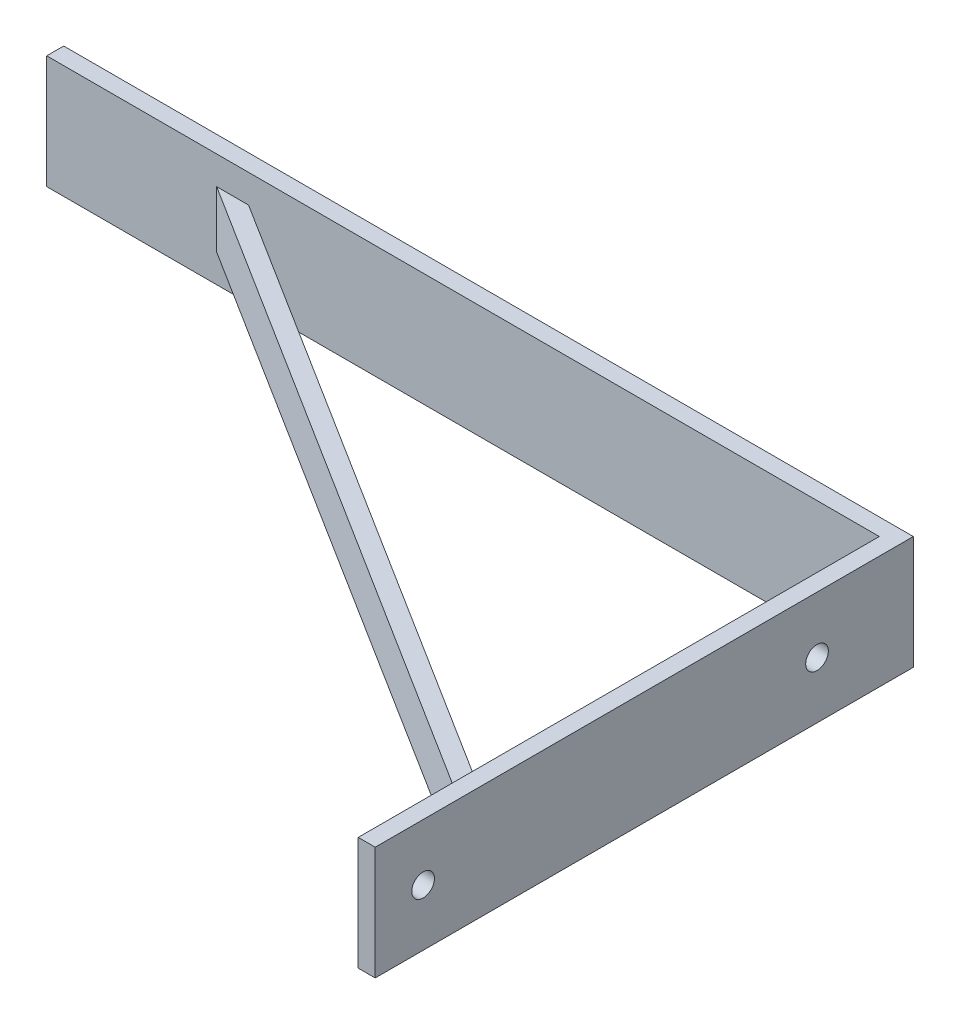
ISO-10303-21;
HEADER;
FILE_DESCRIPTION(('STEP AP214'),'2;1');
FILE_NAME('part.step','',(''),(''),'','','');
FILE_SCHEMA(('AUTOMOTIVE_DESIGN { 1 0 10303 214 1 1 1 1 }'));
ENDSEC;
DATA;
#1=APPLICATION_CONTEXT('core data for automotive mechanical design processes');
#2=APPLICATION_PROTOCOL_DEFINITION('international standard','automotive_design',2000,#1);
#3=PRODUCT_CONTEXT('',#1,'mechanical');
#4=PRODUCT('Part','Part','',(#3));
#5=PRODUCT_RELATED_PRODUCT_CATEGORY('part','',(#4));
#6=PRODUCT_DEFINITION_FORMATION('','',#4);
#7=PRODUCT_DEFINITION_CONTEXT('part definition',#1,'design');
#8=PRODUCT_DEFINITION('design','',#6,#7);
#9=PRODUCT_DEFINITION_SHAPE('','',#8);
#10=(LENGTH_UNIT() NAMED_UNIT(*) SI_UNIT(.MILLI.,.METRE.));
#11=(NAMED_UNIT(*) PLANE_ANGLE_UNIT() SI_UNIT($,.RADIAN.));
#12=(NAMED_UNIT(*) SI_UNIT($,.STERADIAN.) SOLID_ANGLE_UNIT());
#13=UNCERTAINTY_MEASURE_WITH_UNIT(LENGTH_MEASURE(1.E-05),#10,'distance_accuracy_value','');
#14=(GEOMETRIC_REPRESENTATION_CONTEXT(3) GLOBAL_UNCERTAINTY_ASSIGNED_CONTEXT((#13)) GLOBAL_UNIT_ASSIGNED_CONTEXT((#10,
#11,#12)) REPRESENTATION_CONTEXT('',''));
#15=CARTESIAN_POINT('',(0.,0.,0.));
#16=DIRECTION('',(0.,0.,1.));
#17=DIRECTION('',(1.,0.,0.));
#18=AXIS2_PLACEMENT_3D('',#15,#16,#17);
#19=CARTESIAN_POINT('',(-33.1355439491657,20.,52.7152195219303));
#20=DIRECTION('',(0.532174574123282,0.,-0.846634645320343));
#21=DIRECTION('',(-0.846634645320343,0.,-0.532174574123282));
#22=AXIS2_PLACEMENT_3D('',#19,#20,#21);
#23=PLANE('',#22);
#24=DIRECTION('',(0.846634645320343,0.,0.532174574123282));
#25=VECTOR('',#24,1.);
#26=CARTESIAN_POINT('',(-117.,15.,0.));
#27=LINE('',#26,#25);
#28=CARTESIAN_POINT('',(-117.,15.,0.));
#29=VERTEX_POINT('',#28);
#30=CARTESIAN_POINT('',(0.,15.,73.5434411012851));
#31=VERTEX_POINT('',#30);
#32=EDGE_CURVE('E355',#29,#31,#27,.T.);
#33=ORIENTED_EDGE('',*,*,#32,.F.);
#34=DIRECTION('',(0.,-1.,0.));
#35=VECTOR('',#34,1.);
#36=CARTESIAN_POINT('',(-117.,20.,0.));
#37=LINE('',#36,#35);
#38=CARTESIAN_POINT('',(-117.,5.,0.));
#39=VERTEX_POINT('',#38);
#40=EDGE_CURVE('E120',#29,#39,#37,.T.);
#41=ORIENTED_EDGE('',*,*,#40,.T.);
#42=DIRECTION('',(-0.846634645320343,0.,-0.532174574123282));
#43=VECTOR('',#42,1.);
#44=CARTESIAN_POINT('',(0.,5.,73.5434411012851));
#45=LINE('',#44,#43);
#46=CARTESIAN_POINT('',(0.,5.,73.5434411012851));
#47=VERTEX_POINT('',#46);
#48=EDGE_CURVE('E171',#47,#39,#45,.T.);
#49=ORIENTED_EDGE('',*,*,#48,.F.);
#50=DIRECTION('',(0.,-1.,0.));
#51=VECTOR('',#50,1.);
#52=CARTESIAN_POINT('',(0.,20.,73.5434411012851));
#53=LINE('',#52,#51);
#54=EDGE_CURVE('E124',#31,#47,#53,.T.);
#55=ORIENTED_EDGE('',*,*,#54,.F.);
#56=EDGE_LOOP('',(#33,#41,#49,#55));
#57=FACE_BOUND('',#56,.T.);
#58=ADVANCED_FACE('F34',(#57),#23,.F.);
#59=CARTESIAN_POINT('',(-31.5390202267959,20.,50.1753155859692));
#60=DIRECTION('',(0.532174574123282,0.,-0.846634645320343));
#61=DIRECTION('',(-0.846634645320343,0.,-0.532174574123282));
#62=AXIS2_PLACEMENT_3D('',#59,#60,#61);
#63=PLANE('',#62);
#64=DIRECTION('',(0.,-1.,0.));
#65=VECTOR('',#64,1.);
#66=CARTESIAN_POINT('',(-111.36275210077,20.,0.));
#67=LINE('',#66,#65);
#68=CARTESIAN_POINT('',(-111.36275210077,15.,0.));
#69=VERTEX_POINT('',#68);
#70=CARTESIAN_POINT('',(-111.36275210077,5.,0.));
#71=VERTEX_POINT('',#70);
#72=EDGE_CURVE('E38',#69,#71,#67,.T.);
#73=ORIENTED_EDGE('',*,*,#72,.F.);
#74=DIRECTION('',(-0.846634645320343,0.,-0.532174574123282));
#75=VECTOR('',#74,1.);
#76=CARTESIAN_POINT('',(0.,15.,70.));
#77=LINE('',#76,#75);
#78=CARTESIAN_POINT('',(0.,15.,70.));
#79=VERTEX_POINT('',#78);
#80=EDGE_CURVE('E363',#79,#69,#77,.T.);
#81=ORIENTED_EDGE('',*,*,#80,.F.);
#82=DIRECTION('',(0.,-1.,0.));
#83=VECTOR('',#82,1.);
#84=CARTESIAN_POINT('',(0.,20.,70.));
#85=LINE('',#84,#83);
#86=CARTESIAN_POINT('',(0.,5.,70.));
#87=VERTEX_POINT('',#86);
#88=EDGE_CURVE('E128',#79,#87,#85,.T.);
#89=ORIENTED_EDGE('',*,*,#88,.T.);
#90=DIRECTION('',(0.846634645320343,0.,0.532174574123282));
#91=VECTOR('',#90,1.);
#92=CARTESIAN_POINT('',(-111.36275210077,5.,0.));
#93=LINE('',#92,#91);
#94=EDGE_CURVE('E173',#71,#87,#93,.T.);
#95=ORIENTED_EDGE('',*,*,#94,.F.);
#96=EDGE_LOOP('',(#73,#81,#89,#95));
#97=FACE_BOUND('',#96,.T.);
#98=ADVANCED_FACE('F36',(#97),#63,.T.);
#99=CARTESIAN_POINT('',(3.,20.,0.));
#100=DIRECTION('',(-1.,0.,0.));
#101=DIRECTION('',(0.,0.,1.));
#102=AXIS2_PLACEMENT_3D('',#99,#100,#101);
#103=PLANE('',#102);
#104=CARTESIAN_POINT('',(3.,10.,83.5434411012851));
#105=DIRECTION('',(-1.,0.,0.));
#106=DIRECTION('',(0.,0.,1.));
#107=AXIS2_PLACEMENT_3D('',#104,#105,#106);
#108=CIRCLE('',#107,2.);
#109=CARTESIAN_POINT('',(3.,10.,85.5434411012851));
#110=VERTEX_POINT('',#109);
#111=EDGE_CURVE('E190',#110,#110,#108,.T.);
#112=ORIENTED_EDGE('',*,*,#111,.T.);
#113=EDGE_LOOP('',(#112));
#114=FACE_BOUND('',#113,.T.);
#115=CARTESIAN_POINT('',(3.,10.,14.));
#116=DIRECTION('',(-1.,0.,0.));
#117=DIRECTION('',(0.,0.,1.));
#118=AXIS2_PLACEMENT_3D('',#115,#116,#117);
#119=CIRCLE('',#118,2.00000000000001);
#120=CARTESIAN_POINT('',(3.,10.,16.));
#121=VERTEX_POINT('',#120);
#122=EDGE_CURVE('E185',#121,#121,#119,.T.);
#123=ORIENTED_EDGE('',*,*,#122,.T.);
#124=EDGE_LOOP('',(#123));
#125=FACE_BOUND('',#124,.T.);
#126=DIRECTION('',(0.,0.,-1.));
#127=VECTOR('',#126,1.);
#128=CARTESIAN_POINT('',(3.,0.,0.));
#129=LINE('',#128,#127);
#130=CARTESIAN_POINT('',(3.,0.,92.));
#131=VERTEX_POINT('',#130);
#132=CARTESIAN_POINT('',(3.,0.,-3.));
#133=VERTEX_POINT('',#132);
#134=EDGE_CURVE('E192',#131,#133,#129,.T.);
#135=ORIENTED_EDGE('',*,*,#134,.T.);
#136=DIRECTION('',(0.,-1.,0.));
#137=VECTOR('',#136,1.);
#138=CARTESIAN_POINT('',(3.,20.,-3.));
#139=LINE('',#138,#137);
#140=CARTESIAN_POINT('',(3.,20.,-3.));
#141=VERTEX_POINT('',#140);
#142=EDGE_CURVE('E11',#141,#133,#139,.T.);
#143=ORIENTED_EDGE('',*,*,#142,.F.);
#144=DIRECTION('',(0.,0.,-1.));
#145=VECTOR('',#144,1.);
#146=CARTESIAN_POINT('',(3.,20.,0.));
#147=LINE('',#146,#145);
#148=CARTESIAN_POINT('',(3.,20.,92.));
#149=VERTEX_POINT('',#148);
#150=EDGE_CURVE('E195',#149,#141,#147,.T.);
#151=ORIENTED_EDGE('',*,*,#150,.F.);
#152=DIRECTION('',(0.,-1.,0.));
#153=VECTOR('',#152,1.);
#154=CARTESIAN_POINT('',(3.,20.,92.));
#155=LINE('',#154,#153);
#156=EDGE_CURVE('E131',#149,#131,#155,.T.);
#157=ORIENTED_EDGE('',*,*,#156,.T.);
#158=EDGE_LOOP('',(#135,#143,#151,#157));
#159=FACE_BOUND('',#158,.T.);
#160=ADVANCED_FACE('F209',(#114,#125,#159),#103,.F.);
#161=CARTESIAN_POINT('',(0.,20.,-3.));
#162=DIRECTION('',(0.,0.,1.));
#163=DIRECTION('',(1.,0.,0.));
#164=AXIS2_PLACEMENT_3D('',#161,#162,#163);
#165=PLANE('',#164);
#166=DIRECTION('',(-1.,0.,0.));
#167=VECTOR('',#166,1.);
#168=CARTESIAN_POINT('',(0.,0.,-3.));
#169=LINE('',#168,#167);
#170=CARTESIAN_POINT('',(-147.,0.,-2.99999999999998));
#171=VERTEX_POINT('',#170);
#172=EDGE_CURVE('E203',#133,#171,#169,.T.);
#173=ORIENTED_EDGE('',*,*,#172,.T.);
#174=DIRECTION('',(0.,-1.,0.));
#175=VECTOR('',#174,1.);
#176=CARTESIAN_POINT('',(-147.,20.,-2.99999999999998));
#177=LINE('',#176,#175);
#178=CARTESIAN_POINT('',(-147.,20.,-2.99999999999998));
#179=VERTEX_POINT('',#178);
#180=EDGE_CURVE('E44',#179,#171,#177,.T.);
#181=ORIENTED_EDGE('',*,*,#180,.F.);
#182=DIRECTION('',(-1.,0.,0.));
#183=VECTOR('',#182,1.);
#184=CARTESIAN_POINT('',(0.,20.,-3.));
#185=LINE('',#184,#183);
#186=EDGE_CURVE('E112',#141,#179,#185,.T.);
#187=ORIENTED_EDGE('',*,*,#186,.F.);
#188=ORIENTED_EDGE('',*,*,#142,.T.);
#189=EDGE_LOOP('',(#173,#181,#187,#188));
#190=FACE_BOUND('',#189,.T.);
#191=ADVANCED_FACE('F205',(#190),#165,.F.);
#192=CARTESIAN_POINT('',(-147.,20.,0.));
#193=DIRECTION('',(1.,0.,0.));
#194=DIRECTION('',(0.,0.,-1.));
#195=AXIS2_PLACEMENT_3D('',#192,#193,#194);
#196=PLANE('',#195);
#197=DIRECTION('',(0.,0.,1.));
#198=VECTOR('',#197,1.);
#199=CARTESIAN_POINT('',(-147.,0.,0.));
#200=LINE('',#199,#198);
#201=CARTESIAN_POINT('',(-147.,0.,0.));
#202=VERTEX_POINT('',#201);
#203=EDGE_CURVE('E119',#171,#202,#200,.T.);
#204=ORIENTED_EDGE('',*,*,#203,.T.);
#205=DIRECTION('',(0.,-1.,0.));
#206=VECTOR('',#205,1.);
#207=CARTESIAN_POINT('',(-147.,20.,0.));
#208=LINE('',#207,#206);
#209=CARTESIAN_POINT('',(-147.,20.,0.));
#210=VERTEX_POINT('',#209);
#211=EDGE_CURVE('E103',#210,#202,#208,.T.);
#212=ORIENTED_EDGE('',*,*,#211,.F.);
#213=DIRECTION('',(0.,0.,1.));
#214=VECTOR('',#213,1.);
#215=CARTESIAN_POINT('',(-147.,20.,0.));
#216=LINE('',#215,#214);
#217=EDGE_CURVE('E110',#179,#210,#216,.T.);
#218=ORIENTED_EDGE('',*,*,#217,.F.);
#219=ORIENTED_EDGE('',*,*,#180,.T.);
#220=EDGE_LOOP('',(#204,#212,#218,#219));
#221=FACE_BOUND('',#220,.T.);
#222=ADVANCED_FACE('F117',(#221),#196,.F.);
#223=CARTESIAN_POINT('',(0.,20.,0.));
#224=DIRECTION('',(0.,0.,-1.));
#225=DIRECTION('',(-1.,0.,0.));
#226=AXIS2_PLACEMENT_3D('',#223,#224,#225);
#227=PLANE('',#226);
#228=ORIENTED_EDGE('',*,*,#40,.F.);
#229=DIRECTION('',(-1.,0.,0.));
#230=VECTOR('',#229,1.);
#231=CARTESIAN_POINT('',(-111.36275210077,15.,0.));
#232=LINE('',#231,#230);
#233=EDGE_CURVE('E360',#69,#29,#232,.T.);
#234=ORIENTED_EDGE('',*,*,#233,.F.);
#235=ORIENTED_EDGE('',*,*,#72,.T.);
#236=DIRECTION('',(1.,0.,0.));
#237=VECTOR('',#236,1.);
#238=CARTESIAN_POINT('',(-117.,5.,0.));
#239=LINE('',#238,#237);
#240=EDGE_CURVE('E176',#39,#71,#239,.T.);
#241=ORIENTED_EDGE('',*,*,#240,.F.);
#242=EDGE_LOOP('',(#228,#234,#235,#241));
#243=FACE_BOUND('',#242,.T.);
#244=DIRECTION('',(1.,0.,0.));
#245=VECTOR('',#244,1.);
#246=CARTESIAN_POINT('',(0.,0.,0.));
#247=LINE('',#246,#245);
#248=CARTESIAN_POINT('',(0.,0.,0.));
#249=VERTEX_POINT('',#248);
#250=EDGE_CURVE('E199',#202,#249,#247,.T.);
#251=ORIENTED_EDGE('',*,*,#250,.T.);
#252=DIRECTION('',(0.,-1.,0.));
#253=VECTOR('',#252,1.);
#254=CARTESIAN_POINT('',(0.,20.,0.));
#255=LINE('',#254,#253);
#256=CARTESIAN_POINT('',(0.,20.,0.));
#257=VERTEX_POINT('',#256);
#258=EDGE_CURVE('E105',#257,#249,#255,.T.);
#259=ORIENTED_EDGE('',*,*,#258,.F.);
#260=DIRECTION('',(1.,0.,0.));
#261=VECTOR('',#260,1.);
#262=CARTESIAN_POINT('',(0.,20.,0.));
#263=LINE('',#262,#261);
#264=EDGE_CURVE('E90',#210,#257,#263,.T.);
#265=ORIENTED_EDGE('',*,*,#264,.F.);
#266=ORIENTED_EDGE('',*,*,#211,.T.);
#267=EDGE_LOOP('',(#251,#259,#265,#266));
#268=FACE_BOUND('',#267,.T.);
#269=ADVANCED_FACE('F101',(#243,#268),#227,.F.);
#270=CARTESIAN_POINT('',(0.,20.,0.));
#271=DIRECTION('',(1.,0.,0.));
#272=DIRECTION('',(0.,0.,-1.));
#273=AXIS2_PLACEMENT_3D('',#270,#271,#272);
#274=PLANE('',#273);
#275=DIRECTION('',(0.,0.,-1.));
#276=VECTOR('',#275,1.);
#277=CARTESIAN_POINT('',(0.,15.,73.5434411012851));
#278=LINE('',#277,#276);
#279=EDGE_CURVE('E161',#31,#79,#278,.T.);
#280=ORIENTED_EDGE('',*,*,#279,.F.);
#281=ORIENTED_EDGE('',*,*,#54,.T.);
#282=DIRECTION('',(0.,0.,1.));
#283=VECTOR('',#282,1.);
#284=CARTESIAN_POINT('',(0.,5.,70.));
#285=LINE('',#284,#283);
#286=EDGE_CURVE('E157',#87,#47,#285,.T.);
#287=ORIENTED_EDGE('',*,*,#286,.F.);
#288=ORIENTED_EDGE('',*,*,#88,.F.);
#289=EDGE_LOOP('',(#280,#281,#287,#288));
#290=FACE_BOUND('',#289,.T.);
#291=CARTESIAN_POINT('',(0.,10.,83.5434411012851));
#292=DIRECTION('',(-1.,0.,0.));
#293=DIRECTION('',(0.,0.,1.));
#294=AXIS2_PLACEMENT_3D('',#291,#292,#293);
#295=CIRCLE('',#294,2.);
#296=CARTESIAN_POINT('',(0.,10.,85.5434411012851));
#297=VERTEX_POINT('',#296);
#298=EDGE_CURVE('E182',#297,#297,#295,.T.);
#299=ORIENTED_EDGE('',*,*,#298,.F.);
#300=EDGE_LOOP('',(#299));
#301=FACE_BOUND('',#300,.T.);
#302=DIRECTION('',(0.,0.,1.));
#303=VECTOR('',#302,1.);
#304=CARTESIAN_POINT('',(0.,0.,0.));
#305=LINE('',#304,#303);
#306=CARTESIAN_POINT('',(0.,0.,92.));
#307=VERTEX_POINT('',#306);
#308=EDGE_CURVE('E77',#249,#307,#305,.T.);
#309=ORIENTED_EDGE('',*,*,#308,.T.);
#310=DIRECTION('',(0.,-1.,0.));
#311=VECTOR('',#310,1.);
#312=CARTESIAN_POINT('',(0.,20.,92.));
#313=LINE('',#312,#311);
#314=CARTESIAN_POINT('',(0.,20.,92.));
#315=VERTEX_POINT('',#314);
#316=EDGE_CURVE('E137',#315,#307,#313,.T.);
#317=ORIENTED_EDGE('',*,*,#316,.F.);
#318=DIRECTION('',(0.,0.,1.));
#319=VECTOR('',#318,1.);
#320=CARTESIAN_POINT('',(0.,20.,0.));
#321=LINE('',#320,#319);
#322=EDGE_CURVE('E107',#257,#315,#321,.T.);
#323=ORIENTED_EDGE('',*,*,#322,.F.);
#324=ORIENTED_EDGE('',*,*,#258,.T.);
#325=EDGE_LOOP('',(#309,#317,#323,#324));
#326=FACE_BOUND('',#325,.T.);
#327=CARTESIAN_POINT('',(0.,10.,14.));
#328=DIRECTION('',(-1.,0.,0.));
#329=DIRECTION('',(0.,0.,1.));
#330=AXIS2_PLACEMENT_3D('',#327,#328,#329);
#331=CIRCLE('',#330,2.00000000000001);
#332=CARTESIAN_POINT('',(0.,10.,16.));
#333=VERTEX_POINT('',#332);
#334=EDGE_CURVE('E178',#333,#333,#331,.T.);
#335=ORIENTED_EDGE('',*,*,#334,.F.);
#336=EDGE_LOOP('',(#335));
#337=FACE_BOUND('',#336,.T.);
#338=ADVANCED_FACE('F153',(#290,#301,#326,#337),#274,.F.);
#339=CARTESIAN_POINT('',(0.,20.,92.));
#340=DIRECTION('',(0.,0.,-1.));
#341=DIRECTION('',(-1.,0.,0.));
#342=AXIS2_PLACEMENT_3D('',#339,#340,#341);
#343=PLANE('',#342);
#344=DIRECTION('',(1.,0.,0.));
#345=VECTOR('',#344,1.);
#346=CARTESIAN_POINT('',(0.,0.,92.));
#347=LINE('',#346,#345);
#348=EDGE_CURVE('E83',#307,#131,#347,.T.);
#349=ORIENTED_EDGE('',*,*,#348,.T.);
#350=ORIENTED_EDGE('',*,*,#156,.F.);
#351=DIRECTION('',(1.,0.,0.));
#352=VECTOR('',#351,1.);
#353=CARTESIAN_POINT('',(0.,20.,92.));
#354=LINE('',#353,#352);
#355=EDGE_CURVE('E53',#315,#149,#354,.T.);
#356=ORIENTED_EDGE('',*,*,#355,.F.);
#357=ORIENTED_EDGE('',*,*,#316,.T.);
#358=EDGE_LOOP('',(#349,#350,#356,#357));
#359=FACE_BOUND('',#358,.T.);
#360=ADVANCED_FACE('F245',(#359),#343,.F.);
#361=CARTESIAN_POINT('',(0.,20.,0.));
#362=DIRECTION('',(0.,1.,0.));
#363=DIRECTION('',(0.,0.,1.));
#364=AXIS2_PLACEMENT_3D('',#361,#362,#363);
#365=PLANE('',#364);
#366=ORIENTED_EDGE('',*,*,#217,.T.);
#367=ORIENTED_EDGE('',*,*,#264,.T.);
#368=ORIENTED_EDGE('',*,*,#322,.T.);
#369=ORIENTED_EDGE('',*,*,#355,.T.);
#370=ORIENTED_EDGE('',*,*,#150,.T.);
#371=ORIENTED_EDGE('',*,*,#186,.T.);
#372=EDGE_LOOP('',(#366,#367,#368,#369,#370,#371));
#373=FACE_BOUND('',#372,.T.);
#374=ADVANCED_FACE('F111',(#373),#365,.T.);
#375=CARTESIAN_POINT('',(0.,0.,0.));
#376=DIRECTION('',(0.,1.,0.));
#377=DIRECTION('',(0.,0.,1.));
#378=AXIS2_PLACEMENT_3D('',#375,#376,#377);
#379=PLANE('',#378);
#380=ORIENTED_EDGE('',*,*,#308,.F.);
#381=ORIENTED_EDGE('',*,*,#250,.F.);
#382=ORIENTED_EDGE('',*,*,#203,.F.);
#383=ORIENTED_EDGE('',*,*,#172,.F.);
#384=ORIENTED_EDGE('',*,*,#134,.F.);
#385=ORIENTED_EDGE('',*,*,#348,.F.);
#386=EDGE_LOOP('',(#380,#381,#382,#383,#384,#385));
#387=FACE_BOUND('',#386,.T.);
#388=ADVANCED_FACE('F208',(#387),#379,.F.);
#389=CARTESIAN_POINT('',(20.,10.,14.));
#390=DIRECTION('',(-1.,0.,0.));
#391=DIRECTION('',(0.,0.,1.));
#392=AXIS2_PLACEMENT_3D('',#389,#390,#391);
#393=CYLINDRICAL_SURFACE('',#392,2.00000000000001);
#394=ORIENTED_EDGE('',*,*,#334,.T.);
#395=EDGE_LOOP('',(#394));
#396=FACE_BOUND('',#395,.T.);
#397=ORIENTED_EDGE('',*,*,#122,.F.);
#398=EDGE_LOOP('',(#397));
#399=FACE_BOUND('',#398,.T.);
#400=ADVANCED_FACE('F262',(#396,#399),#393,.F.);
#401=CARTESIAN_POINT('',(20.,10.,83.5434411012851));
#402=DIRECTION('',(-1.,0.,0.));
#403=DIRECTION('',(0.,0.,1.));
#404=AXIS2_PLACEMENT_3D('',#401,#402,#403);
#405=CYLINDRICAL_SURFACE('',#404,2.);
#406=ORIENTED_EDGE('',*,*,#298,.T.);
#407=EDGE_LOOP('',(#406));
#408=FACE_BOUND('',#407,.T.);
#409=ORIENTED_EDGE('',*,*,#111,.F.);
#410=EDGE_LOOP('',(#409));
#411=FACE_BOUND('',#410,.T.);
#412=ADVANCED_FACE('F271',(#408,#411),#405,.F.);
#413=CARTESIAN_POINT('',(0.,5.,0.));
#414=DIRECTION('',(0.,-1.,0.));
#415=DIRECTION('',(0.,0.,-1.));
#416=AXIS2_PLACEMENT_3D('',#413,#414,#415);
#417=PLANE('',#416);
#418=ORIENTED_EDGE('',*,*,#94,.T.);
#419=ORIENTED_EDGE('',*,*,#286,.T.);
#420=ORIENTED_EDGE('',*,*,#48,.T.);
#421=ORIENTED_EDGE('',*,*,#240,.T.);
#422=EDGE_LOOP('',(#418,#419,#420,#421));
#423=FACE_BOUND('',#422,.T.);
#424=ADVANCED_FACE('F170',(#423),#417,.T.);
#425=CARTESIAN_POINT('',(0.,15.,0.));
#426=DIRECTION('',(0.,1.,0.));
#427=DIRECTION('',(0.,0.,1.));
#428=AXIS2_PLACEMENT_3D('',#425,#426,#427);
#429=PLANE('',#428);
#430=ORIENTED_EDGE('',*,*,#32,.T.);
#431=ORIENTED_EDGE('',*,*,#279,.T.);
#432=ORIENTED_EDGE('',*,*,#80,.T.);
#433=ORIENTED_EDGE('',*,*,#233,.T.);
#434=EDGE_LOOP('',(#430,#431,#432,#433));
#435=FACE_BOUND('',#434,.T.);
#436=ADVANCED_FACE('F284',(#435),#429,.T.);
#437=CLOSED_SHELL('',(#58,#98,#160,#191,#222,#269,#338,#360,#374,#388,#400,#412,#424,#436));
#438=MANIFOLD_SOLID_BREP('B2',#437);
#439=ADVANCED_BREP_SHAPE_REPRESENTATION('',(#18,#438),#14);
#440=SHAPE_DEFINITION_REPRESENTATION(#9,#439);
ENDSEC;
END-ISO-10303-21;
